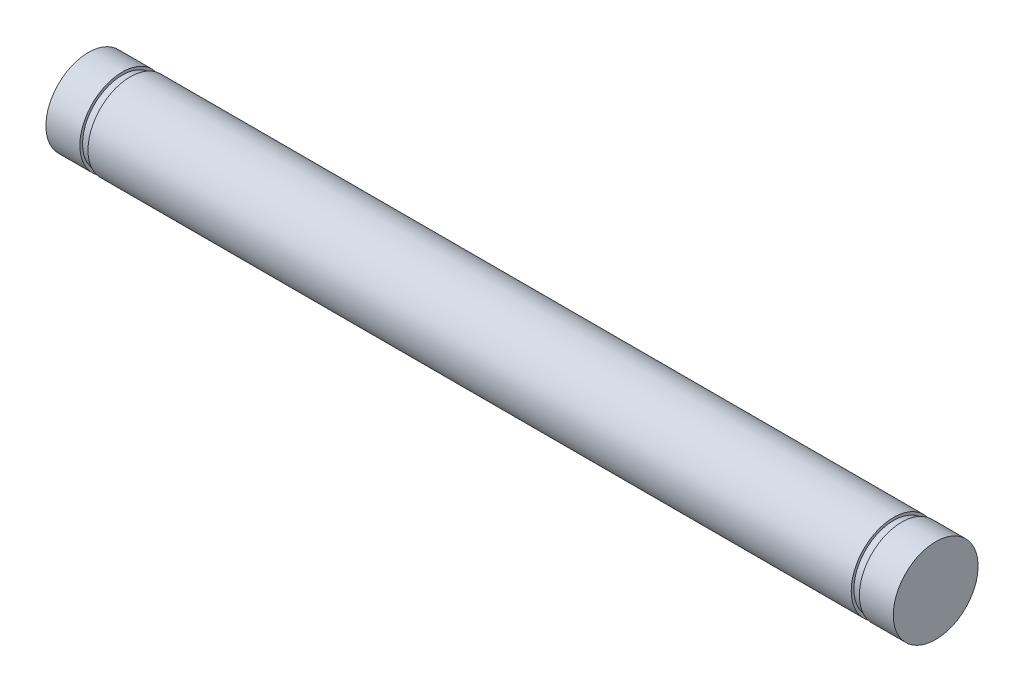
ISO-10303-21;
HEADER;
FILE_DESCRIPTION(('STEP AP214'),'2;1');
FILE_NAME('part.step','',(''),(''),'','','');
FILE_SCHEMA(('AUTOMOTIVE_DESIGN { 1 0 10303 214 1 1 1 1 }'));
ENDSEC;
DATA;
#1=APPLICATION_CONTEXT('core data for automotive mechanical design processes');
#2=APPLICATION_PROTOCOL_DEFINITION('international standard','automotive_design',2000,#1);
#3=PRODUCT_CONTEXT('',#1,'mechanical');
#4=PRODUCT('Part','Part','',(#3));
#5=PRODUCT_RELATED_PRODUCT_CATEGORY('part','',(#4));
#6=PRODUCT_DEFINITION_FORMATION('','',#4);
#7=PRODUCT_DEFINITION_CONTEXT('part definition',#1,'design');
#8=PRODUCT_DEFINITION('design','',#6,#7);
#9=PRODUCT_DEFINITION_SHAPE('','',#8);
#10=(LENGTH_UNIT() NAMED_UNIT(*) SI_UNIT(.MILLI.,.METRE.));
#11=(NAMED_UNIT(*) PLANE_ANGLE_UNIT() SI_UNIT($,.RADIAN.));
#12=(NAMED_UNIT(*) SI_UNIT($,.STERADIAN.) SOLID_ANGLE_UNIT());
#13=UNCERTAINTY_MEASURE_WITH_UNIT(LENGTH_MEASURE(1.E-05),#10,'distance_accuracy_value','');
#14=(GEOMETRIC_REPRESENTATION_CONTEXT(3) GLOBAL_UNCERTAINTY_ASSIGNED_CONTEXT((#13)) GLOBAL_UNIT_ASSIGNED_CONTEXT((#10,
#11,#12)) REPRESENTATION_CONTEXT('',''));
#15=CARTESIAN_POINT('',(0.,0.,0.));
#16=DIRECTION('',(0.,0.,1.));
#17=DIRECTION('',(1.,0.,0.));
#18=AXIS2_PLACEMENT_3D('',#15,#16,#17);
#19=CARTESIAN_POINT('',(-25.4,0.,0.));
#20=DIRECTION('',(1.,0.,0.));
#21=DIRECTION('',(0.,0.,-1.));
#22=AXIS2_PLACEMENT_3D('',#19,#20,#21);
#23=CYLINDRICAL_SURFACE('',#22,1.5875);
#24=CARTESIAN_POINT('',(-23.7998,0.,0.));
#25=DIRECTION('',(1.,0.,0.));
#26=DIRECTION('',(0.,0.,-1.));
#27=AXIS2_PLACEMENT_3D('',#24,#25,#26);
#28=CIRCLE('',#27,1.5875);
#29=CARTESIAN_POINT('',(-23.7998,0.,-1.58750000000002));
#30=VERTEX_POINT('',#29);
#31=EDGE_CURVE('E11',#30,#30,#28,.F.);
#32=ORIENTED_EDGE('',*,*,#31,.F.);
#33=EDGE_LOOP('',(#32));
#34=FACE_BOUND('',#33,.T.);
#35=CARTESIAN_POINT('',(-22.5298,0.,0.));
#36=DIRECTION('',(-1.,0.,0.));
#37=DIRECTION('',(0.,0.,1.));
#38=AXIS2_PLACEMENT_3D('',#35,#36,#37);
#39=CIRCLE('',#38,1.5875);
#40=CARTESIAN_POINT('',(-22.5298,0.,1.5875));
#41=VERTEX_POINT('',#40);
#42=EDGE_CURVE('E44',#41,#41,#39,.F.);
#43=ORIENTED_EDGE('',*,*,#42,.F.);
#44=EDGE_LOOP('',(#43));
#45=FACE_BOUND('',#44,.T.);
#46=ADVANCED_FACE('F34',(#34,#45),#23,.T.);
#47=CARTESIAN_POINT('',(-22.5298,0.,0.));
#48=DIRECTION('',(-1.,0.,0.));
#49=DIRECTION('',(0.,0.,1.));
#50=AXIS2_PLACEMENT_3D('',#47,#48,#49);
#51=PLANE('',#50);
#52=ORIENTED_EDGE('',*,*,#42,.T.);
#53=EDGE_LOOP('',(#52));
#54=FACE_BOUND('',#53,.T.);
#55=CARTESIAN_POINT('',(-22.5298,0.,0.));
#56=DIRECTION('',(-1.,0.,0.));
#57=DIRECTION('',(0.,0.,1.));
#58=AXIS2_PLACEMENT_3D('',#55,#56,#57);
#59=CIRCLE('',#58,1.4859);
#60=CARTESIAN_POINT('',(-22.5298,0.,1.4859));
#61=VERTEX_POINT('',#60);
#62=EDGE_CURVE('E61',#61,#61,#59,.T.);
#63=ORIENTED_EDGE('',*,*,#62,.T.);
#64=EDGE_LOOP('',(#63));
#65=FACE_BOUND('',#64,.T.);
#66=ADVANCED_FACE('F93',(#54,#65),#51,.F.);
#67=CARTESIAN_POINT('',(-22.225,0.,0.));
#68=DIRECTION('',(-1.,0.,0.));
#69=DIRECTION('',(0.,0.,1.));
#70=AXIS2_PLACEMENT_3D('',#67,#68,#69);
#71=PLANE('',#70);
#72=CARTESIAN_POINT('',(-22.225,0.,0.));
#73=DIRECTION('',(-1.,0.,0.));
#74=DIRECTION('',(0.,0.,1.));
#75=AXIS2_PLACEMENT_3D('',#72,#73,#74);
#76=CIRCLE('',#75,1.5875);
#77=CARTESIAN_POINT('',(-22.225,0.,1.5875));
#78=VERTEX_POINT('',#77);
#79=EDGE_CURVE('E48',#78,#78,#76,.F.);
#80=ORIENTED_EDGE('',*,*,#79,.F.);
#81=EDGE_LOOP('',(#80));
#82=FACE_BOUND('',#81,.T.);
#83=CARTESIAN_POINT('',(-22.225,0.,0.));
#84=DIRECTION('',(-1.,0.,0.));
#85=DIRECTION('',(0.,0.,1.));
#86=AXIS2_PLACEMENT_3D('',#83,#84,#85);
#87=CIRCLE('',#86,1.4859);
#88=CARTESIAN_POINT('',(-22.225,0.,1.48589999999999));
#89=VERTEX_POINT('',#88);
#90=EDGE_CURVE('E54',#89,#89,#87,.T.);
#91=ORIENTED_EDGE('',*,*,#90,.F.);
#92=EDGE_LOOP('',(#91));
#93=FACE_BOUND('',#92,.T.);
#94=ADVANCED_FACE('F98',(#82,#93),#71,.T.);
#95=CARTESIAN_POINT('',(-22.5298,0.,0.));
#96=DIRECTION('',(1.,0.,0.));
#97=DIRECTION('',(0.,0.,-1.));
#98=AXIS2_PLACEMENT_3D('',#95,#96,#97);
#99=CYLINDRICAL_SURFACE('',#98,1.4859);
#100=ORIENTED_EDGE('',*,*,#62,.F.);
#101=EDGE_LOOP('',(#100));
#102=FACE_BOUND('',#101,.T.);
#103=ORIENTED_EDGE('',*,*,#90,.T.);
#104=EDGE_LOOP('',(#103));
#105=FACE_BOUND('',#104,.T.);
#106=ADVANCED_FACE('F87',(#102,#105),#99,.T.);
#107=CARTESIAN_POINT('',(6.35000000000004,0.,0.));
#108=DIRECTION('',(-1.,0.,0.));
#109=DIRECTION('',(0.,0.,1.));
#110=AXIS2_PLACEMENT_3D('',#107,#108,#109);
#111=CIRCLE('',#110,1.5875);
#112=CARTESIAN_POINT('',(6.35000000000004,0.,1.58749999999999));
#113=VERTEX_POINT('',#112);
#114=EDGE_CURVE('E55',#113,#113,#111,.F.);
#115=ORIENTED_EDGE('',*,*,#114,.F.);
#116=EDGE_LOOP('',(#115));
#117=FACE_BOUND('',#116,.T.);
#118=ORIENTED_EDGE('',*,*,#79,.T.);
#119=EDGE_LOOP('',(#118));
#120=FACE_BOUND('',#119,.T.);
#121=ADVANCED_FACE('F78',(#117,#120),#23,.T.);
#122=CARTESIAN_POINT('',(6.65480000000003,0.,0.));
#123=DIRECTION('',(-1.,0.,0.));
#124=DIRECTION('',(0.,0.,1.));
#125=AXIS2_PLACEMENT_3D('',#122,#123,#124);
#126=PLANE('',#125);
#127=CARTESIAN_POINT('',(6.65480000000003,0.,0.));
#128=DIRECTION('',(-1.,0.,0.));
#129=DIRECTION('',(0.,0.,1.));
#130=AXIS2_PLACEMENT_3D('',#127,#128,#129);
#131=CIRCLE('',#130,1.5875);
#132=CARTESIAN_POINT('',(6.65480000000003,0.,1.58749999999999));
#133=VERTEX_POINT('',#132);
#134=EDGE_CURVE('E51',#133,#133,#131,.F.);
#135=ORIENTED_EDGE('',*,*,#134,.F.);
#136=EDGE_LOOP('',(#135));
#137=FACE_BOUND('',#136,.T.);
#138=CARTESIAN_POINT('',(6.65480000000003,0.,0.));
#139=DIRECTION('',(-1.,0.,0.));
#140=DIRECTION('',(0.,0.,1.));
#141=AXIS2_PLACEMENT_3D('',#138,#139,#140);
#142=CIRCLE('',#141,1.4859);
#143=CARTESIAN_POINT('',(6.65480000000003,0.,1.48589999999999));
#144=VERTEX_POINT('',#143);
#145=EDGE_CURVE('E57',#144,#144,#142,.T.);
#146=ORIENTED_EDGE('',*,*,#145,.F.);
#147=EDGE_LOOP('',(#146));
#148=FACE_BOUND('',#147,.T.);
#149=ADVANCED_FACE('F75',(#137,#148),#126,.T.);
#150=CARTESIAN_POINT('',(6.35000000000004,0.,0.));
#151=DIRECTION('',(-1.,0.,0.));
#152=DIRECTION('',(0.,0.,1.));
#153=AXIS2_PLACEMENT_3D('',#150,#151,#152);
#154=PLANE('',#153);
#155=ORIENTED_EDGE('',*,*,#114,.T.);
#156=EDGE_LOOP('',(#155));
#157=FACE_BOUND('',#156,.T.);
#158=CARTESIAN_POINT('',(6.35000000000004,0.,0.));
#159=DIRECTION('',(-1.,0.,0.));
#160=DIRECTION('',(0.,0.,1.));
#161=AXIS2_PLACEMENT_3D('',#158,#159,#160);
#162=CIRCLE('',#161,1.4859);
#163=CARTESIAN_POINT('',(6.35000000000004,0.,1.48589999999999));
#164=VERTEX_POINT('',#163);
#165=EDGE_CURVE('E66',#164,#164,#162,.T.);
#166=ORIENTED_EDGE('',*,*,#165,.T.);
#167=EDGE_LOOP('',(#166));
#168=FACE_BOUND('',#167,.T.);
#169=ADVANCED_FACE('F77',(#157,#168),#154,.F.);
#170=CARTESIAN_POINT('',(6.65480000000003,0.,0.));
#171=DIRECTION('',(-1.,0.,0.));
#172=DIRECTION('',(0.,0.,1.));
#173=AXIS2_PLACEMENT_3D('',#170,#171,#172);
#174=CYLINDRICAL_SURFACE('',#173,1.4859);
#175=ORIENTED_EDGE('',*,*,#145,.T.);
#176=EDGE_LOOP('',(#175));
#177=FACE_BOUND('',#176,.T.);
#178=ORIENTED_EDGE('',*,*,#165,.F.);
#179=EDGE_LOOP('',(#178));
#180=FACE_BOUND('',#179,.T.);
#181=ADVANCED_FACE('F72',(#177,#180),#174,.T.);
#182=CARTESIAN_POINT('',(7.92480000000002,0.,0.));
#183=DIRECTION('',(-1.,0.,0.));
#184=DIRECTION('',(0.,0.,1.));
#185=AXIS2_PLACEMENT_3D('',#182,#183,#184);
#186=CIRCLE('',#185,1.5875);
#187=CARTESIAN_POINT('',(7.92480000000002,0.,1.5875));
#188=VERTEX_POINT('',#187);
#189=EDGE_CURVE('E40',#188,#188,#186,.F.);
#190=ORIENTED_EDGE('',*,*,#189,.F.);
#191=EDGE_LOOP('',(#190));
#192=FACE_BOUND('',#191,.T.);
#193=ORIENTED_EDGE('',*,*,#134,.T.);
#194=EDGE_LOOP('',(#193));
#195=FACE_BOUND('',#194,.T.);
#196=ADVANCED_FACE('F89',(#192,#195),#23,.T.);
#197=CARTESIAN_POINT('',(7.9248,3.175,-1.58750000000002));
#198=DIRECTION('',(-1.,0.,0.));
#199=DIRECTION('',(0.,0.,1.));
#200=AXIS2_PLACEMENT_3D('',#197,#198,#199);
#201=PLANE('',#200);
#202=ORIENTED_EDGE('',*,*,#189,.T.);
#203=EDGE_LOOP('',(#202));
#204=FACE_BOUND('',#203,.T.);
#205=ADVANCED_FACE('F103',(#204),#201,.F.);
#206=CARTESIAN_POINT('',(-23.7998,3.17499999999999,-1.58750000000001));
#207=DIRECTION('',(1.,0.,0.));
#208=DIRECTION('',(0.,0.,-1.));
#209=AXIS2_PLACEMENT_3D('',#206,#207,#208);
#210=PLANE('',#209);
#211=ORIENTED_EDGE('',*,*,#31,.T.);
#212=EDGE_LOOP('',(#211));
#213=FACE_BOUND('',#212,.T.);
#214=ADVANCED_FACE('F109',(#213),#210,.F.);
#215=CLOSED_SHELL('',(#46,#66,#94,#106,#121,#149,#169,#181,#196,#205,#214));
#216=MANIFOLD_SOLID_BREP('B2',#215);
#217=ADVANCED_BREP_SHAPE_REPRESENTATION('',(#18,#216),#14);
#218=SHAPE_DEFINITION_REPRESENTATION(#9,#217);
ENDSEC;
END-ISO-10303-21;
